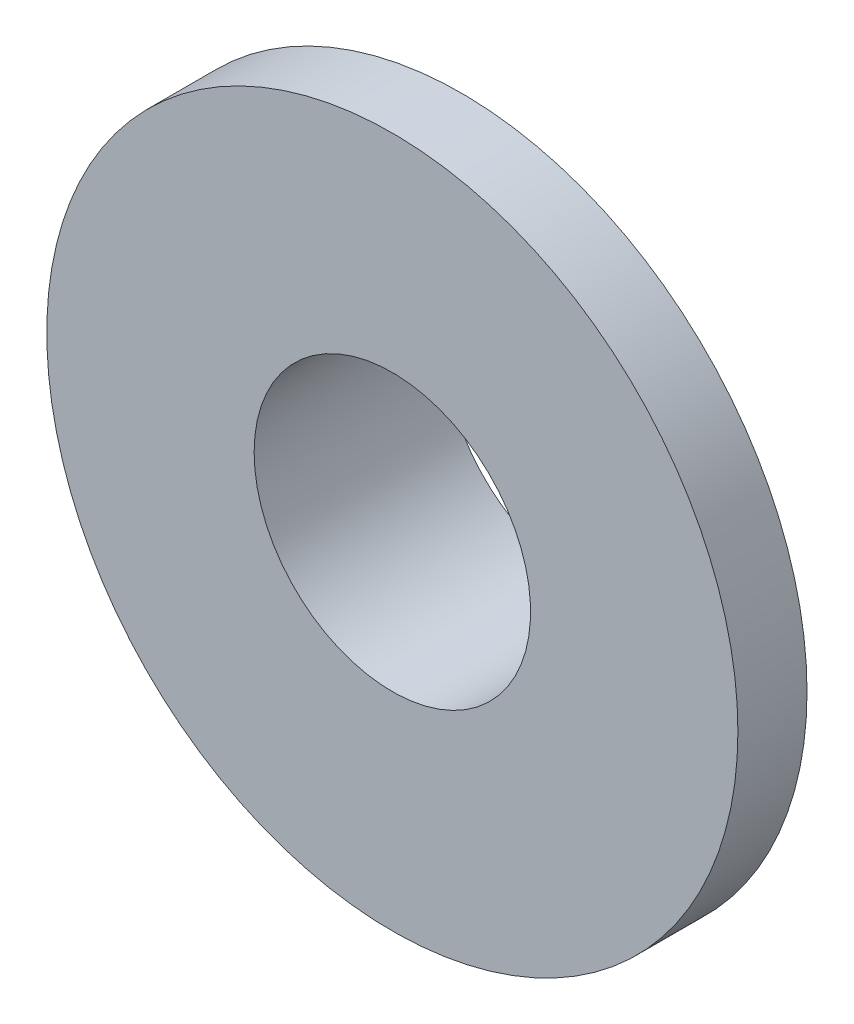
ISO-10303-21;
HEADER;
FILE_DESCRIPTION(('STEP AP214'),'2;1');
FILE_NAME('part.step','',(''),(''),'','','');
FILE_SCHEMA(('AUTOMOTIVE_DESIGN { 1 0 10303 214 1 1 1 1 }'));
ENDSEC;
DATA;
#1=APPLICATION_CONTEXT('core data for automotive mechanical design processes');
#2=APPLICATION_PROTOCOL_DEFINITION('international standard','automotive_design',2000,#1);
#3=PRODUCT_CONTEXT('',#1,'mechanical');
#4=PRODUCT('Part','Part','',(#3));
#5=PRODUCT_RELATED_PRODUCT_CATEGORY('part','',(#4));
#6=PRODUCT_DEFINITION_FORMATION('','',#4);
#7=PRODUCT_DEFINITION_CONTEXT('part definition',#1,'design');
#8=PRODUCT_DEFINITION('design','',#6,#7);
#9=PRODUCT_DEFINITION_SHAPE('','',#8);
#10=(LENGTH_UNIT() NAMED_UNIT(*) SI_UNIT(.MILLI.,.METRE.));
#11=(NAMED_UNIT(*) PLANE_ANGLE_UNIT() SI_UNIT($,.RADIAN.));
#12=(NAMED_UNIT(*) SI_UNIT($,.STERADIAN.) SOLID_ANGLE_UNIT());
#13=UNCERTAINTY_MEASURE_WITH_UNIT(LENGTH_MEASURE(1.E-05),#10,'distance_accuracy_value','');
#14=(GEOMETRIC_REPRESENTATION_CONTEXT(3) GLOBAL_UNCERTAINTY_ASSIGNED_CONTEXT((#13)) GLOBAL_UNIT_ASSIGNED_CONTEXT((#10,
#11,#12)) REPRESENTATION_CONTEXT('',''));
#15=CARTESIAN_POINT('',(0.,0.,0.));
#16=DIRECTION('',(0.,0.,1.));
#17=DIRECTION('',(1.,0.,0.));
#18=AXIS2_PLACEMENT_3D('',#15,#16,#17);
#19=CARTESIAN_POINT('',(0.,0.,2.));
#20=DIRECTION('',(0.,0.,-1.));
#21=DIRECTION('',(-1.,0.,0.));
#22=AXIS2_PLACEMENT_3D('',#19,#20,#21);
#23=CYLINDRICAL_SURFACE('',#22,10.);
#24=CARTESIAN_POINT('',(0.,0.,2.));
#25=DIRECTION('',(0.,0.,1.));
#26=DIRECTION('',(1.,0.,0.));
#27=AXIS2_PLACEMENT_3D('',#24,#25,#26);
#28=CIRCLE('',#27,10.);
#29=CARTESIAN_POINT('',(10.,0.,2.));
#30=VERTEX_POINT('',#29);
#31=EDGE_CURVE('E38',#30,#30,#28,.T.);
#32=ORIENTED_EDGE('',*,*,#31,.F.);
#33=EDGE_LOOP('',(#32));
#34=FACE_BOUND('',#33,.T.);
#35=CARTESIAN_POINT('',(0.,0.,0.));
#36=DIRECTION('',(0.,0.,1.));
#37=DIRECTION('',(1.,0.,0.));
#38=AXIS2_PLACEMENT_3D('',#35,#36,#37);
#39=CIRCLE('',#38,10.);
#40=CARTESIAN_POINT('',(10.,0.,0.));
#41=VERTEX_POINT('',#40);
#42=EDGE_CURVE('E34',#41,#41,#39,.T.);
#43=ORIENTED_EDGE('',*,*,#42,.T.);
#44=EDGE_LOOP('',(#43));
#45=FACE_BOUND('',#44,.T.);
#46=ADVANCED_FACE('F31',(#34,#45),#23,.T.);
#47=CARTESIAN_POINT('',(0.,0.,2.));
#48=DIRECTION('',(0.,0.,1.));
#49=DIRECTION('',(1.,0.,0.));
#50=AXIS2_PLACEMENT_3D('',#47,#48,#49);
#51=PLANE('',#50);
#52=CARTESIAN_POINT('',(0.,0.,2.));
#53=DIRECTION('',(0.,0.,-1.));
#54=DIRECTION('',(-1.,0.,0.));
#55=AXIS2_PLACEMENT_3D('',#52,#53,#54);
#56=CIRCLE('',#55,4.);
#57=CARTESIAN_POINT('',(-4.,0.,2.));
#58=VERTEX_POINT('',#57);
#59=EDGE_CURVE('E47',#58,#58,#56,.T.);
#60=ORIENTED_EDGE('',*,*,#59,.T.);
#61=EDGE_LOOP('',(#60));
#62=FACE_BOUND('',#61,.T.);
#63=ORIENTED_EDGE('',*,*,#31,.T.);
#64=EDGE_LOOP('',(#63));
#65=FACE_BOUND('',#64,.T.);
#66=ADVANCED_FACE('F54',(#62,#65),#51,.T.);
#67=CARTESIAN_POINT('',(0.,0.,0.));
#68=DIRECTION('',(0.,0.,1.));
#69=DIRECTION('',(1.,0.,0.));
#70=AXIS2_PLACEMENT_3D('',#67,#68,#69);
#71=PLANE('',#70);
#72=CARTESIAN_POINT('',(0.,0.,0.));
#73=DIRECTION('',(0.,0.,-1.));
#74=DIRECTION('',(-1.,0.,0.));
#75=AXIS2_PLACEMENT_3D('',#72,#73,#74);
#76=CIRCLE('',#75,4.5);
#77=CARTESIAN_POINT('',(-4.5,0.,0.));
#78=VERTEX_POINT('',#77);
#79=EDGE_CURVE('E10',#78,#78,#76,.T.);
#80=ORIENTED_EDGE('',*,*,#79,.F.);
#81=EDGE_LOOP('',(#80));
#82=FACE_BOUND('',#81,.T.);
#83=ORIENTED_EDGE('',*,*,#42,.F.);
#84=EDGE_LOOP('',(#83));
#85=FACE_BOUND('',#84,.T.);
#86=ADVANCED_FACE('F71',(#82,#85),#71,.F.);
#87=CARTESIAN_POINT('',(0.,0.,-3.5));
#88=DIRECTION('',(0.,0.,1.));
#89=DIRECTION('',(1.,0.,0.));
#90=AXIS2_PLACEMENT_3D('',#87,#88,#89);
#91=CYLINDRICAL_SURFACE('',#90,4.5);
#92=CARTESIAN_POINT('',(0.,0.,-3.5));
#93=DIRECTION('',(0.,0.,-1.));
#94=DIRECTION('',(-1.,0.,0.));
#95=AXIS2_PLACEMENT_3D('',#92,#93,#94);
#96=CIRCLE('',#95,4.5);
#97=CARTESIAN_POINT('',(-4.5,0.,-3.5));
#98=VERTEX_POINT('',#97);
#99=EDGE_CURVE('E44',#98,#98,#96,.T.);
#100=ORIENTED_EDGE('',*,*,#99,.F.);
#101=EDGE_LOOP('',(#100));
#102=FACE_BOUND('',#101,.T.);
#103=ORIENTED_EDGE('',*,*,#79,.T.);
#104=EDGE_LOOP('',(#103));
#105=FACE_BOUND('',#104,.T.);
#106=ADVANCED_FACE('F66',(#102,#105),#91,.T.);
#107=CARTESIAN_POINT('',(0.,0.,-3.5));
#108=DIRECTION('',(0.,0.,-1.));
#109=DIRECTION('',(-1.,0.,0.));
#110=AXIS2_PLACEMENT_3D('',#107,#108,#109);
#111=PLANE('',#110);
#112=CARTESIAN_POINT('',(0.,0.,-3.5));
#113=DIRECTION('',(0.,0.,-1.));
#114=DIRECTION('',(-1.,0.,0.));
#115=AXIS2_PLACEMENT_3D('',#112,#113,#114);
#116=CIRCLE('',#115,4.);
#117=CARTESIAN_POINT('',(-4.,0.,-3.5));
#118=VERTEX_POINT('',#117);
#119=EDGE_CURVE('E48',#118,#118,#116,.T.);
#120=ORIENTED_EDGE('',*,*,#119,.F.);
#121=EDGE_LOOP('',(#120));
#122=FACE_BOUND('',#121,.T.);
#123=ORIENTED_EDGE('',*,*,#99,.T.);
#124=EDGE_LOOP('',(#123));
#125=FACE_BOUND('',#124,.T.);
#126=ADVANCED_FACE('F60',(#122,#125),#111,.T.);
#127=CARTESIAN_POINT('',(0.,0.,2.));
#128=DIRECTION('',(0.,0.,-1.));
#129=DIRECTION('',(-1.,0.,0.));
#130=AXIS2_PLACEMENT_3D('',#127,#128,#129);
#131=CYLINDRICAL_SURFACE('',#130,4.);
#132=ORIENTED_EDGE('',*,*,#59,.F.);
#133=EDGE_LOOP('',(#132));
#134=FACE_BOUND('',#133,.T.);
#135=ORIENTED_EDGE('',*,*,#119,.T.);
#136=EDGE_LOOP('',(#135));
#137=FACE_BOUND('',#136,.T.);
#138=ADVANCED_FACE('F57',(#134,#137),#131,.F.);
#139=CLOSED_SHELL('',(#46,#66,#86,#106,#126,#138));
#140=MANIFOLD_SOLID_BREP('B2',#139);
#141=ADVANCED_BREP_SHAPE_REPRESENTATION('',(#18,#140),#14);
#142=SHAPE_DEFINITION_REPRESENTATION(#9,#141);
ENDSEC;
END-ISO-10303-21;
